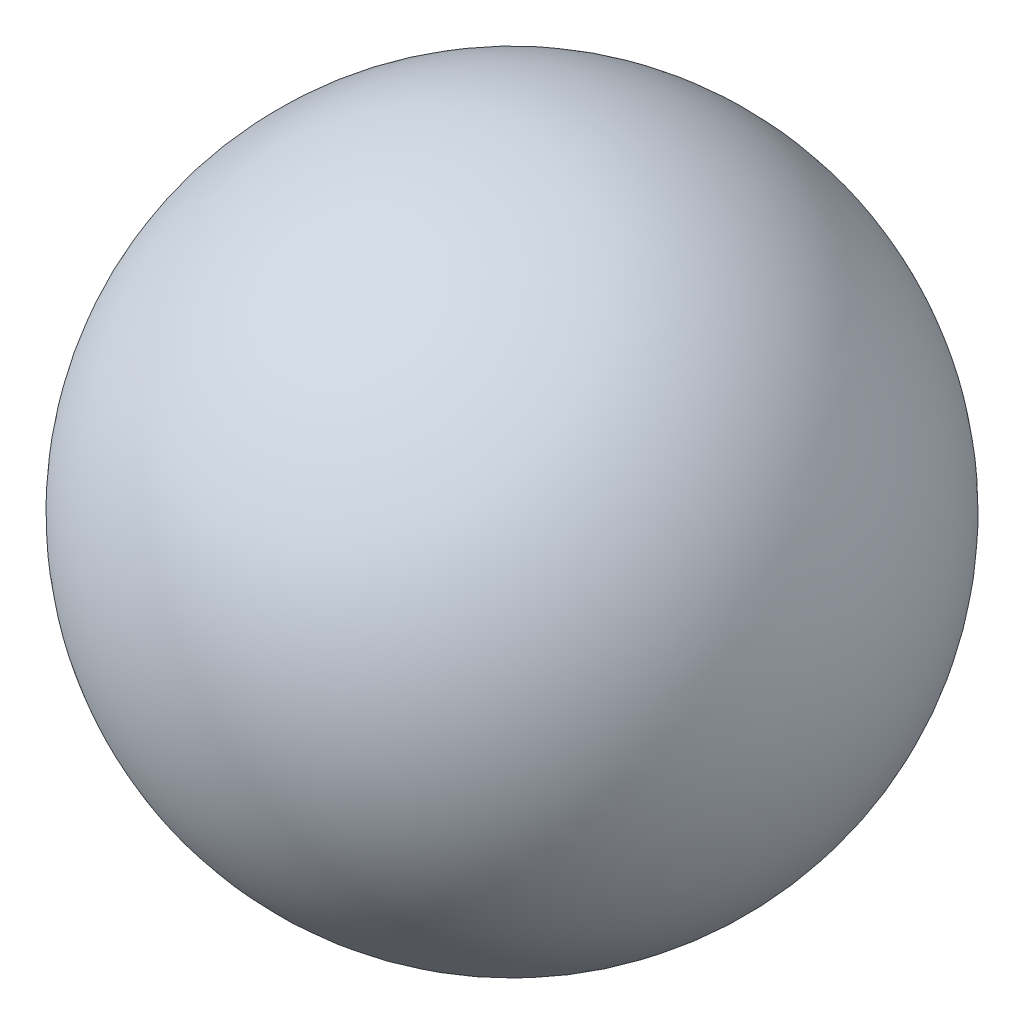
ISO-10303-21;
HEADER;
FILE_DESCRIPTION(('STEP AP214'),'2;1');
FILE_NAME('part.step','',(''),(''),'','','');
FILE_SCHEMA(('AUTOMOTIVE_DESIGN { 1 0 10303 214 1 1 1 1 }'));
ENDSEC;
DATA;
#1=APPLICATION_CONTEXT('core data for automotive mechanical design processes');
#2=APPLICATION_PROTOCOL_DEFINITION('international standard','automotive_design',2000,#1);
#3=PRODUCT_CONTEXT('',#1,'mechanical');
#4=PRODUCT('Part','Part','',(#3));
#5=PRODUCT_RELATED_PRODUCT_CATEGORY('part','',(#4));
#6=PRODUCT_DEFINITION_FORMATION('','',#4);
#7=PRODUCT_DEFINITION_CONTEXT('part definition',#1,'design');
#8=PRODUCT_DEFINITION('design','',#6,#7);
#9=PRODUCT_DEFINITION_SHAPE('','',#8);
#10=(LENGTH_UNIT() NAMED_UNIT(*) SI_UNIT(.MILLI.,.METRE.));
#11=(NAMED_UNIT(*) PLANE_ANGLE_UNIT() SI_UNIT($,.RADIAN.));
#12=(NAMED_UNIT(*) SI_UNIT($,.STERADIAN.) SOLID_ANGLE_UNIT());
#13=UNCERTAINTY_MEASURE_WITH_UNIT(LENGTH_MEASURE(1.E-05),#10,'distance_accuracy_value','');
#14=(GEOMETRIC_REPRESENTATION_CONTEXT(3) GLOBAL_UNCERTAINTY_ASSIGNED_CONTEXT((#13)) GLOBAL_UNIT_ASSIGNED_CONTEXT((#10,
#11,#12)) REPRESENTATION_CONTEXT('',''));
#15=CARTESIAN_POINT('',(0.,0.,0.));
#16=DIRECTION('',(0.,0.,1.));
#17=DIRECTION('',(1.,0.,0.));
#18=AXIS2_PLACEMENT_3D('',#15,#16,#17);
#19=CARTESIAN_POINT('',(8.1084283849148,-2.,8.5038749477346));
#20=DIRECTION('',(0.,0.,1.));
#21=DIRECTION('',(1.,0.,0.));
#22=AXIS2_PLACEMENT_3D('',#19,#20,#21);
#23=SPHERICAL_SURFACE('',#22,1.05);
#24=CARTESIAN_POINT('',(8.1084283849148,-2.,9.5538749477346));
#25=VERTEX_POINT('',#24);
#26=VERTEX_LOOP('',#25);
#27=FACE_BOUND('',#26,.T.);
#28=ADVANCED_FACE('F12',(#27),#23,.T.);
#29=CLOSED_SHELL('',(#28));
#30=MANIFOLD_SOLID_BREP('B1',#29);
#31=ADVANCED_BREP_SHAPE_REPRESENTATION('',(#18,#30),#14);
#32=SHAPE_DEFINITION_REPRESENTATION(#9,#31);
ENDSEC;
END-ISO-10303-21;
